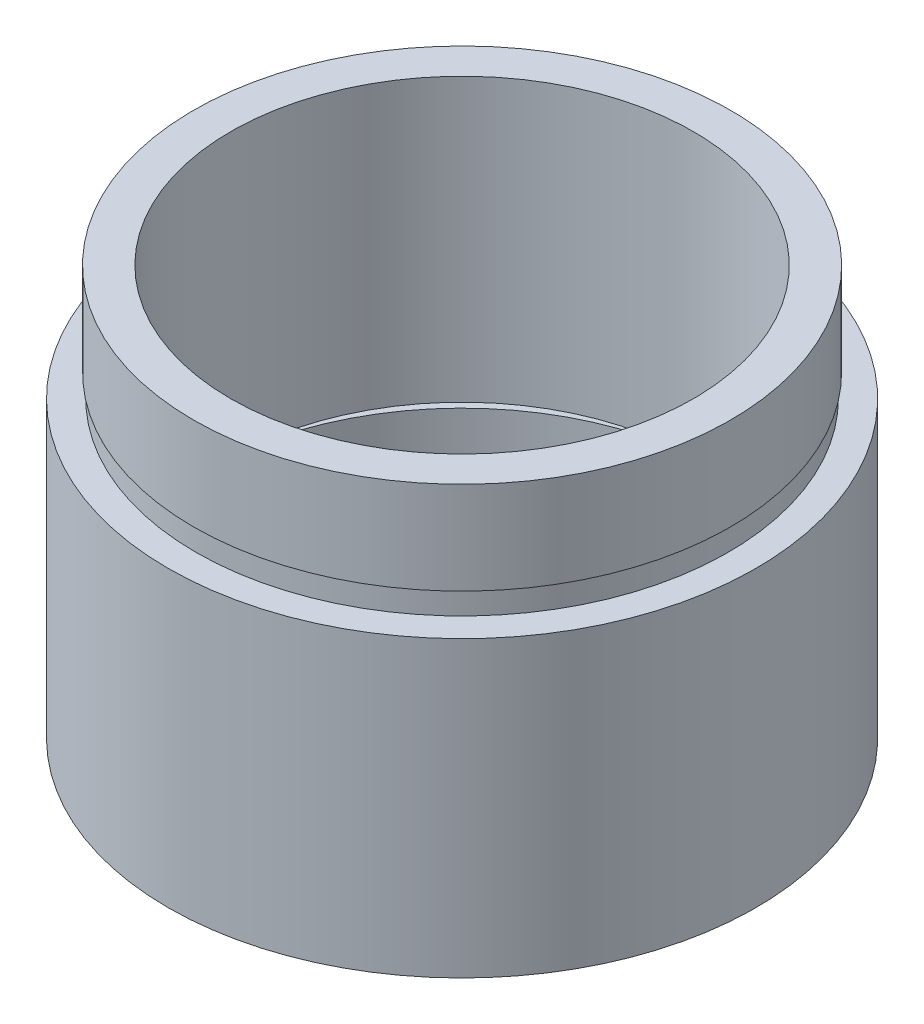
ISO-10303-21;
HEADER;
FILE_DESCRIPTION(('STEP AP214'),'2;1');
FILE_NAME('part.step','',(''),(''),'','','');
FILE_SCHEMA(('AUTOMOTIVE_DESIGN { 1 0 10303 214 1 1 1 1 }'));
ENDSEC;
DATA;
#1=APPLICATION_CONTEXT('core data for automotive mechanical design processes');
#2=APPLICATION_PROTOCOL_DEFINITION('international standard','automotive_design',2000,#1);
#3=PRODUCT_CONTEXT('',#1,'mechanical');
#4=PRODUCT('Part','Part','',(#3));
#5=PRODUCT_RELATED_PRODUCT_CATEGORY('part','',(#4));
#6=PRODUCT_DEFINITION_FORMATION('','',#4);
#7=PRODUCT_DEFINITION_CONTEXT('part definition',#1,'design');
#8=PRODUCT_DEFINITION('design','',#6,#7);
#9=PRODUCT_DEFINITION_SHAPE('','',#8);
#10=(LENGTH_UNIT() NAMED_UNIT(*) SI_UNIT(.MILLI.,.METRE.));
#11=(NAMED_UNIT(*) PLANE_ANGLE_UNIT() SI_UNIT($,.RADIAN.));
#12=(NAMED_UNIT(*) SI_UNIT($,.STERADIAN.) SOLID_ANGLE_UNIT());
#13=UNCERTAINTY_MEASURE_WITH_UNIT(LENGTH_MEASURE(1.E-05),#10,'distance_accuracy_value','');
#14=(GEOMETRIC_REPRESENTATION_CONTEXT(3) GLOBAL_UNCERTAINTY_ASSIGNED_CONTEXT((#13)) GLOBAL_UNIT_ASSIGNED_CONTEXT((#10,
#11,#12)) REPRESENTATION_CONTEXT('',''));
#15=CARTESIAN_POINT('',(0.,0.,0.));
#16=DIRECTION('',(0.,0.,1.));
#17=DIRECTION('',(1.,0.,0.));
#18=AXIS2_PLACEMENT_3D('',#15,#16,#17);
#19=CARTESIAN_POINT('',(11.1,0.,0.));
#20=DIRECTION('',(0.,1.,0.));
#21=DIRECTION('',(0.,0.,1.));
#22=AXIS2_PLACEMENT_3D('',#19,#20,#21);
#23=PLANE('',#22);
#24=CARTESIAN_POINT('',(0.,0.,0.));
#25=DIRECTION('',(0.,1.,0.));
#26=DIRECTION('',(0.,0.,1.));
#27=AXIS2_PLACEMENT_3D('',#24,#25,#26);
#28=CIRCLE('',#27,12.7);
#29=CARTESIAN_POINT('',(0.,0.,12.7));
#30=VERTEX_POINT('',#29);
#31=EDGE_CURVE('E10',#30,#30,#28,.T.);
#32=ORIENTED_EDGE('',*,*,#31,.F.);
#33=EDGE_LOOP('',(#32));
#34=FACE_BOUND('',#33,.T.);
#35=CARTESIAN_POINT('',(0.,0.,0.));
#36=DIRECTION('',(0.,1.,0.));
#37=DIRECTION('',(0.,0.,1.));
#38=AXIS2_PLACEMENT_3D('',#35,#36,#37);
#39=CIRCLE('',#38,11.1);
#40=CARTESIAN_POINT('',(0.,0.,11.1));
#41=VERTEX_POINT('',#40);
#42=EDGE_CURVE('E77',#41,#41,#39,.T.);
#43=ORIENTED_EDGE('',*,*,#42,.T.);
#44=EDGE_LOOP('',(#43));
#45=FACE_BOUND('',#44,.T.);
#46=ADVANCED_FACE('F37',(#34,#45),#23,.F.);
#47=CARTESIAN_POINT('',(0.,161.376166943427,0.));
#48=DIRECTION('',(0.,1.,0.));
#49=DIRECTION('',(0.,0.,1.));
#50=AXIS2_PLACEMENT_3D('',#47,#48,#49);
#51=CYLINDRICAL_SURFACE('',#50,12.7);
#52=CARTESIAN_POINT('',(0.,12.7,0.));
#53=DIRECTION('',(0.,1.,0.));
#54=DIRECTION('',(0.,0.,1.));
#55=AXIS2_PLACEMENT_3D('',#52,#53,#54);
#56=CIRCLE('',#55,12.7);
#57=CARTESIAN_POINT('',(0.,12.7,12.7));
#58=VERTEX_POINT('',#57);
#59=EDGE_CURVE('E43',#58,#58,#56,.T.);
#60=ORIENTED_EDGE('',*,*,#59,.F.);
#61=EDGE_LOOP('',(#60));
#62=FACE_BOUND('',#61,.T.);
#63=ORIENTED_EDGE('',*,*,#31,.T.);
#64=EDGE_LOOP('',(#63));
#65=FACE_BOUND('',#64,.T.);
#66=ADVANCED_FACE('F138',(#62,#65),#51,.T.);
#67=CARTESIAN_POINT('',(12.7,12.7,0.));
#68=DIRECTION('',(0.,-1.,0.));
#69=DIRECTION('',(0.,0.,-1.));
#70=AXIS2_PLACEMENT_3D('',#67,#68,#69);
#71=PLANE('',#70);
#72=CARTESIAN_POINT('',(0.,12.7,0.));
#73=DIRECTION('',(0.,1.,0.));
#74=DIRECTION('',(0.,0.,1.));
#75=AXIS2_PLACEMENT_3D('',#72,#73,#74);
#76=CIRCLE('',#75,11.5);
#77=CARTESIAN_POINT('',(0.,12.7,11.5));
#78=VERTEX_POINT('',#77);
#79=EDGE_CURVE('E47',#78,#78,#76,.T.);
#80=ORIENTED_EDGE('',*,*,#79,.F.);
#81=EDGE_LOOP('',(#80));
#82=FACE_BOUND('',#81,.T.);
#83=ORIENTED_EDGE('',*,*,#59,.T.);
#84=EDGE_LOOP('',(#83));
#85=FACE_BOUND('',#84,.T.);
#86=ADVANCED_FACE('F133',(#82,#85),#71,.F.);
#87=CARTESIAN_POINT('',(0.,161.376166943427,0.));
#88=DIRECTION('',(0.,1.,0.));
#89=DIRECTION('',(0.,0.,1.));
#90=AXIS2_PLACEMENT_3D('',#87,#88,#89);
#91=CYLINDRICAL_SURFACE('',#90,11.5);
#92=CARTESIAN_POINT('',(0.,13.7,0.));
#93=DIRECTION('',(0.,1.,0.));
#94=DIRECTION('',(0.,0.,1.));
#95=AXIS2_PLACEMENT_3D('',#92,#93,#94);
#96=CIRCLE('',#95,11.5);
#97=CARTESIAN_POINT('',(0.,13.7,11.5));
#98=VERTEX_POINT('',#97);
#99=EDGE_CURVE('E51',#98,#98,#96,.T.);
#100=ORIENTED_EDGE('',*,*,#99,.F.);
#101=EDGE_LOOP('',(#100));
#102=FACE_BOUND('',#101,.T.);
#103=ORIENTED_EDGE('',*,*,#79,.T.);
#104=EDGE_LOOP('',(#103));
#105=FACE_BOUND('',#104,.T.);
#106=ADVANCED_FACE('F127',(#102,#105),#91,.T.);
#107=CARTESIAN_POINT('',(11.5,13.7,0.));
#108=DIRECTION('',(0.,1.,0.));
#109=DIRECTION('',(0.,0.,1.));
#110=AXIS2_PLACEMENT_3D('',#107,#108,#109);
#111=PLANE('',#110);
#112=CARTESIAN_POINT('',(0.,13.7,0.));
#113=DIRECTION('',(0.,1.,0.));
#114=DIRECTION('',(0.,0.,1.));
#115=AXIS2_PLACEMENT_3D('',#112,#113,#114);
#116=CIRCLE('',#115,11.6);
#117=CARTESIAN_POINT('',(0.,13.7,11.6));
#118=VERTEX_POINT('',#117);
#119=EDGE_CURVE('E56',#118,#118,#116,.T.);
#120=ORIENTED_EDGE('',*,*,#119,.F.);
#121=EDGE_LOOP('',(#120));
#122=FACE_BOUND('',#121,.T.);
#123=ORIENTED_EDGE('',*,*,#99,.T.);
#124=EDGE_LOOP('',(#123));
#125=FACE_BOUND('',#124,.T.);
#126=ADVANCED_FACE('F121',(#122,#125),#111,.F.);
#127=CARTESIAN_POINT('',(0.,161.376166943427,0.));
#128=DIRECTION('',(0.,1.,0.));
#129=DIRECTION('',(0.,0.,1.));
#130=AXIS2_PLACEMENT_3D('',#127,#128,#129);
#131=CYLINDRICAL_SURFACE('',#130,11.6);
#132=CARTESIAN_POINT('',(0.,17.7,0.));
#133=DIRECTION('',(0.,1.,0.));
#134=DIRECTION('',(0.,0.,1.));
#135=AXIS2_PLACEMENT_3D('',#132,#133,#134);
#136=CIRCLE('',#135,11.6);
#137=CARTESIAN_POINT('',(0.,17.7,11.6));
#138=VERTEX_POINT('',#137);
#139=EDGE_CURVE('E59',#138,#138,#136,.T.);
#140=ORIENTED_EDGE('',*,*,#139,.F.);
#141=EDGE_LOOP('',(#140));
#142=FACE_BOUND('',#141,.T.);
#143=ORIENTED_EDGE('',*,*,#119,.T.);
#144=EDGE_LOOP('',(#143));
#145=FACE_BOUND('',#144,.T.);
#146=ADVANCED_FACE('F115',(#142,#145),#131,.T.);
#147=CARTESIAN_POINT('',(11.6,17.7,0.));
#148=DIRECTION('',(0.,-1.,0.));
#149=DIRECTION('',(0.,0.,-1.));
#150=AXIS2_PLACEMENT_3D('',#147,#148,#149);
#151=PLANE('',#150);
#152=CARTESIAN_POINT('',(0.,17.7,0.));
#153=DIRECTION('',(0.,1.,0.));
#154=DIRECTION('',(0.,0.,1.));
#155=AXIS2_PLACEMENT_3D('',#152,#153,#154);
#156=CIRCLE('',#155,10.);
#157=CARTESIAN_POINT('',(0.,17.7,10.));
#158=VERTEX_POINT('',#157);
#159=EDGE_CURVE('E62',#158,#158,#156,.T.);
#160=ORIENTED_EDGE('',*,*,#159,.F.);
#161=EDGE_LOOP('',(#160));
#162=FACE_BOUND('',#161,.T.);
#163=ORIENTED_EDGE('',*,*,#139,.T.);
#164=EDGE_LOOP('',(#163));
#165=FACE_BOUND('',#164,.T.);
#166=ADVANCED_FACE('F109',(#162,#165),#151,.F.);
#167=CARTESIAN_POINT('',(0.,161.376166943427,0.));
#168=DIRECTION('',(0.,1.,0.));
#169=DIRECTION('',(0.,0.,1.));
#170=AXIS2_PLACEMENT_3D('',#167,#168,#169);
#171=CYLINDRICAL_SURFACE('',#170,10.);
#172=CARTESIAN_POINT('',(0.,5.49999999999998,0.));
#173=DIRECTION('',(0.,1.,0.));
#174=DIRECTION('',(0.,0.,1.));
#175=AXIS2_PLACEMENT_3D('',#172,#173,#174);
#176=CIRCLE('',#175,10.);
#177=CARTESIAN_POINT('',(0.,5.49999999999998,10.));
#178=VERTEX_POINT('',#177);
#179=EDGE_CURVE('E65',#178,#178,#176,.T.);
#180=ORIENTED_EDGE('',*,*,#179,.F.);
#181=EDGE_LOOP('',(#180));
#182=FACE_BOUND('',#181,.T.);
#183=ORIENTED_EDGE('',*,*,#159,.T.);
#184=EDGE_LOOP('',(#183));
#185=FACE_BOUND('',#184,.T.);
#186=ADVANCED_FACE('F103',(#182,#185),#171,.F.);
#187=CARTESIAN_POINT('',(11.7,5.49999999999998,0.));
#188=DIRECTION('',(0.,1.,0.));
#189=DIRECTION('',(0.,0.,1.));
#190=AXIS2_PLACEMENT_3D('',#187,#188,#189);
#191=PLANE('',#190);
#192=CARTESIAN_POINT('',(0.,5.49999999999998,0.));
#193=DIRECTION('',(0.,1.,0.));
#194=DIRECTION('',(0.,0.,1.));
#195=AXIS2_PLACEMENT_3D('',#192,#193,#194);
#196=CIRCLE('',#195,11.7);
#197=CARTESIAN_POINT('',(0.,5.49999999999998,11.7));
#198=VERTEX_POINT('',#197);
#199=EDGE_CURVE('E68',#198,#198,#196,.T.);
#200=ORIENTED_EDGE('',*,*,#199,.F.);
#201=EDGE_LOOP('',(#200));
#202=FACE_BOUND('',#201,.T.);
#203=ORIENTED_EDGE('',*,*,#179,.T.);
#204=EDGE_LOOP('',(#203));
#205=FACE_BOUND('',#204,.T.);
#206=ADVANCED_FACE('F97',(#202,#205),#191,.F.);
#207=CARTESIAN_POINT('',(0.,161.376166943427,0.));
#208=DIRECTION('',(0.,1.,0.));
#209=DIRECTION('',(0.,0.,1.));
#210=AXIS2_PLACEMENT_3D('',#207,#208,#209);
#211=CYLINDRICAL_SURFACE('',#210,11.7);
#212=CARTESIAN_POINT('',(0.,4.49999999999998,0.));
#213=DIRECTION('',(0.,1.,0.));
#214=DIRECTION('',(0.,0.,1.));
#215=AXIS2_PLACEMENT_3D('',#212,#213,#214);
#216=CIRCLE('',#215,11.7);
#217=CARTESIAN_POINT('',(0.,4.49999999999998,11.7));
#218=VERTEX_POINT('',#217);
#219=EDGE_CURVE('E71',#218,#218,#216,.T.);
#220=ORIENTED_EDGE('',*,*,#219,.F.);
#221=EDGE_LOOP('',(#220));
#222=FACE_BOUND('',#221,.T.);
#223=ORIENTED_EDGE('',*,*,#199,.T.);
#224=EDGE_LOOP('',(#223));
#225=FACE_BOUND('',#224,.T.);
#226=ADVANCED_FACE('F91',(#222,#225),#211,.F.);
#227=CARTESIAN_POINT('',(11.1,4.49999999999998,0.));
#228=DIRECTION('',(0.,-1.,0.));
#229=DIRECTION('',(0.,0.,-1.));
#230=AXIS2_PLACEMENT_3D('',#227,#228,#229);
#231=PLANE('',#230);
#232=CARTESIAN_POINT('',(0.,4.49999999999998,0.));
#233=DIRECTION('',(0.,1.,0.));
#234=DIRECTION('',(0.,0.,1.));
#235=AXIS2_PLACEMENT_3D('',#232,#233,#234);
#236=CIRCLE('',#235,11.1);
#237=CARTESIAN_POINT('',(0.,4.49999999999998,11.1));
#238=VERTEX_POINT('',#237);
#239=EDGE_CURVE('E74',#238,#238,#236,.T.);
#240=ORIENTED_EDGE('',*,*,#239,.F.);
#241=EDGE_LOOP('',(#240));
#242=FACE_BOUND('',#241,.T.);
#243=ORIENTED_EDGE('',*,*,#219,.T.);
#244=EDGE_LOOP('',(#243));
#245=FACE_BOUND('',#244,.T.);
#246=ADVANCED_FACE('F85',(#242,#245),#231,.F.);
#247=CARTESIAN_POINT('',(0.,161.376166943427,0.));
#248=DIRECTION('',(0.,1.,0.));
#249=DIRECTION('',(0.,0.,1.));
#250=AXIS2_PLACEMENT_3D('',#247,#248,#249);
#251=CYLINDRICAL_SURFACE('',#250,11.1);
#252=ORIENTED_EDGE('',*,*,#42,.F.);
#253=EDGE_LOOP('',(#252));
#254=FACE_BOUND('',#253,.T.);
#255=ORIENTED_EDGE('',*,*,#239,.T.);
#256=EDGE_LOOP('',(#255));
#257=FACE_BOUND('',#256,.T.);
#258=ADVANCED_FACE('F82',(#254,#257),#251,.F.);
#259=CLOSED_SHELL('',(#46,#66,#86,#106,#126,#146,#166,#186,#206,#226,#246,#258));
#260=MANIFOLD_SOLID_BREP('B2',#259);
#261=ADVANCED_BREP_SHAPE_REPRESENTATION('',(#18,#260),#14);
#262=SHAPE_DEFINITION_REPRESENTATION(#9,#261);
ENDSEC;
END-ISO-10303-21;
